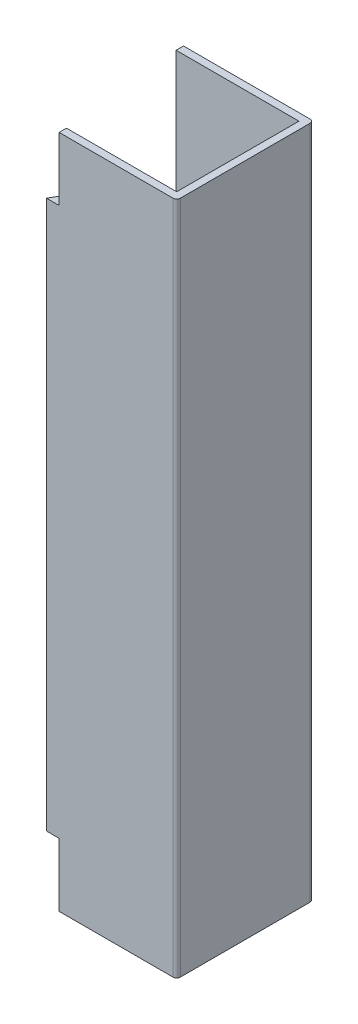
ISO-10303-21;
HEADER;
FILE_DESCRIPTION(('STEP AP214'),'2;1');
FILE_NAME('part.step','',(''),(''),'','','');
FILE_SCHEMA(('AUTOMOTIVE_DESIGN { 1 0 10303 214 1 1 1 1 }'));
ENDSEC;
DATA;
#1=APPLICATION_CONTEXT('core data for automotive mechanical design processes');
#2=APPLICATION_PROTOCOL_DEFINITION('international standard','automotive_design',2000,#1);
#3=PRODUCT_CONTEXT('',#1,'mechanical');
#4=PRODUCT('Part','Part','',(#3));
#5=PRODUCT_RELATED_PRODUCT_CATEGORY('part','',(#4));
#6=PRODUCT_DEFINITION_FORMATION('','',#4);
#7=PRODUCT_DEFINITION_CONTEXT('part definition',#1,'design');
#8=PRODUCT_DEFINITION('design','',#6,#7);
#9=PRODUCT_DEFINITION_SHAPE('','',#8);
#10=(LENGTH_UNIT() NAMED_UNIT(*) SI_UNIT(.MILLI.,.METRE.));
#11=(NAMED_UNIT(*) PLANE_ANGLE_UNIT() SI_UNIT($,.RADIAN.));
#12=(NAMED_UNIT(*) SI_UNIT($,.STERADIAN.) SOLID_ANGLE_UNIT());
#13=UNCERTAINTY_MEASURE_WITH_UNIT(LENGTH_MEASURE(1.E-05),#10,'distance_accuracy_value','');
#14=(GEOMETRIC_REPRESENTATION_CONTEXT(3) GLOBAL_UNCERTAINTY_ASSIGNED_CONTEXT((#13)) GLOBAL_UNIT_ASSIGNED_CONTEXT((#10,
#11,#12)) REPRESENTATION_CONTEXT('',''));
#15=CARTESIAN_POINT('',(0.,0.,0.));
#16=DIRECTION('',(0.,0.,1.));
#17=DIRECTION('',(1.,0.,0.));
#18=AXIS2_PLACEMENT_3D('',#15,#16,#17);
#19=CARTESIAN_POINT('',(3.115,-1.6,0.0175));
#20=DIRECTION('',(1.,0.,0.));
#21=DIRECTION('',(0.,1.,0.));
#22=AXIS2_PLACEMENT_3D('',#19,#20,#21);
#23=PLANE('',#22);
#24=DIRECTION('',(0.,0.,1.));
#25=VECTOR('',#24,1.);
#26=CARTESIAN_POINT('',(3.115,1.6,0.0175));
#27=LINE('',#26,#25);
#28=CARTESIAN_POINT('',(3.115,1.6,0.0349999999999998));
#29=VERTEX_POINT('',#28);
#30=CARTESIAN_POINT('',(3.115,1.6,0.615));
#31=VERTEX_POINT('',#30);
#32=EDGE_CURVE('E119',#29,#31,#27,.T.);
#33=ORIENTED_EDGE('',*,*,#32,.F.);
#34=DIRECTION('',(0.,1.,0.));
#35=VECTOR('',#34,1.);
#36=CARTESIAN_POINT('',(3.115,-1.6,0.0350000000000007));
#37=LINE('',#36,#35);
#38=CARTESIAN_POINT('',(3.115,-1.6,0.0350000000000005));
#39=VERTEX_POINT('',#38);
#40=EDGE_CURVE('E116',#29,#39,#37,.F.);
#41=ORIENTED_EDGE('',*,*,#40,.T.);
#42=DIRECTION('',(0.,0.,1.));
#43=VECTOR('',#42,1.);
#44=CARTESIAN_POINT('',(3.115,-1.6,0.0175));
#45=LINE('',#44,#43);
#46=CARTESIAN_POINT('',(3.115,-1.6,0.615));
#47=VERTEX_POINT('',#46);
#48=EDGE_CURVE('E112',#47,#39,#45,.F.);
#49=ORIENTED_EDGE('',*,*,#48,.F.);
#50=DIRECTION('',(0.,1.,0.));
#51=VECTOR('',#50,1.);
#52=CARTESIAN_POINT('',(3.115,0.,0.615));
#53=LINE('',#52,#51);
#54=EDGE_CURVE('E114',#31,#47,#53,.F.);
#55=ORIENTED_EDGE('',*,*,#54,.F.);
#56=EDGE_LOOP('',(#33,#41,#49,#55));
#57=FACE_BOUND('',#56,.T.);
#58=ADVANCED_FACE('F17',(#57),#23,.F.);
#59=CARTESIAN_POINT('',(2.5325,-1.6,0.035));
#60=DIRECTION('',(0.,0.,-1.));
#61=DIRECTION('',(-1.,0.,0.));
#62=AXIS2_PLACEMENT_3D('',#59,#60,#61);
#63=PLANE('',#62);
#64=DIRECTION('',(-1.,0.,0.));
#65=VECTOR('',#64,1.);
#66=CARTESIAN_POINT('',(2.5325,1.6,0.0349999999999989));
#67=LINE('',#66,#65);
#68=CARTESIAN_POINT('',(2.5325,1.6,0.0349999999999996));
#69=VERTEX_POINT('',#68);
#70=EDGE_CURVE('E150',#69,#29,#67,.F.);
#71=ORIENTED_EDGE('',*,*,#70,.F.);
#72=DIRECTION('',(0.,-1.,0.));
#73=VECTOR('',#72,1.);
#74=CARTESIAN_POINT('',(2.5325,0.,0.035));
#75=LINE('',#74,#73);
#76=CARTESIAN_POINT('',(2.5325,-1.6,0.035));
#77=VERTEX_POINT('',#76);
#78=EDGE_CURVE('E231',#77,#69,#75,.F.);
#79=ORIENTED_EDGE('',*,*,#78,.F.);
#80=DIRECTION('',(-1.,0.,0.));
#81=VECTOR('',#80,1.);
#82=CARTESIAN_POINT('',(2.5325,-1.6,0.035));
#83=LINE('',#82,#81);
#84=EDGE_CURVE('E144',#39,#77,#83,.T.);
#85=ORIENTED_EDGE('',*,*,#84,.F.);
#86=ORIENTED_EDGE('',*,*,#40,.F.);
#87=EDGE_LOOP('',(#71,#79,#85,#86));
#88=FACE_BOUND('',#87,.T.);
#89=ADVANCED_FACE('F272',(#88),#63,.F.);
#90=CARTESIAN_POINT('',(2.828508757436,0.,0.615));
#91=DIRECTION('',(0.,0.,-1.));
#92=DIRECTION('',(0.,1.,0.));
#93=AXIS2_PLACEMENT_3D('',#90,#91,#92);
#94=PLANE('',#93);
#95=DIRECTION('',(0.,1.,0.));
#96=VECTOR('',#95,1.);
#97=CARTESIAN_POINT('',(2.5925,0.,0.615));
#98=LINE('',#97,#96);
#99=CARTESIAN_POINT('',(2.5925,1.3,0.615));
#100=VERTEX_POINT('',#99);
#101=CARTESIAN_POINT('',(2.5925,1.6,0.615));
#102=VERTEX_POINT('',#101);
#103=EDGE_CURVE('E248',#100,#102,#98,.T.);
#104=ORIENTED_EDGE('',*,*,#103,.T.);
#105=DIRECTION('',(1.,0.,0.));
#106=VECTOR('',#105,1.);
#107=CARTESIAN_POINT('',(2.828508757436,1.6,0.615));
#108=LINE('',#107,#106);
#109=EDGE_CURVE('E127',#102,#31,#108,.T.);
#110=ORIENTED_EDGE('',*,*,#109,.T.);
#111=ORIENTED_EDGE('',*,*,#54,.T.);
#112=DIRECTION('',(1.,0.,0.));
#113=VECTOR('',#112,1.);
#114=CARTESIAN_POINT('',(2.828508757436,-1.6,0.615));
#115=LINE('',#114,#113);
#116=CARTESIAN_POINT('',(2.5925,-1.6,0.615));
#117=VERTEX_POINT('',#116);
#118=EDGE_CURVE('E124',#47,#117,#115,.F.);
#119=ORIENTED_EDGE('',*,*,#118,.T.);
#120=DIRECTION('',(0.,1.,0.));
#121=VECTOR('',#120,1.);
#122=CARTESIAN_POINT('',(2.5925,0.,0.615));
#123=LINE('',#122,#121);
#124=CARTESIAN_POINT('',(2.5925,-1.3,0.615));
#125=VERTEX_POINT('',#124);
#126=EDGE_CURVE('E134',#117,#125,#123,.T.);
#127=ORIENTED_EDGE('',*,*,#126,.T.);
#128=DIRECTION('',(1.,0.,0.));
#129=VECTOR('',#128,1.);
#130=CARTESIAN_POINT('',(2.828508757436,-1.3,0.615));
#131=LINE('',#130,#129);
#132=CARTESIAN_POINT('',(2.55270725942,-1.3,0.615));
#133=VERTEX_POINT('',#132);
#134=EDGE_CURVE('E136',#125,#133,#131,.F.);
#135=ORIENTED_EDGE('',*,*,#134,.T.);
#136=DIRECTION('',(0.,1.,0.));
#137=VECTOR('',#136,1.);
#138=CARTESIAN_POINT('',(2.55270725942,-1.3,0.615));
#139=LINE('',#138,#137);
#140=CARTESIAN_POINT('',(2.55270725942,1.3,0.615));
#141=VERTEX_POINT('',#140);
#142=EDGE_CURVE('E218',#133,#141,#139,.T.);
#143=ORIENTED_EDGE('',*,*,#142,.T.);
#144=DIRECTION('',(1.,0.,0.));
#145=VECTOR('',#144,1.);
#146=CARTESIAN_POINT('',(2.5925,1.3,0.615));
#147=LINE('',#146,#145);
#148=EDGE_CURVE('E236',#100,#141,#147,.F.);
#149=ORIENTED_EDGE('',*,*,#148,.F.);
#150=EDGE_LOOP('',(#104,#110,#111,#119,#127,#135,#143,#149));
#151=FACE_BOUND('',#150,.T.);
#152=ADVANCED_FACE('F123',(#151),#94,.T.);
#153=CARTESIAN_POINT('',(2.5325,0.,0.0175));
#154=DIRECTION('',(-1.,0.,0.));
#155=DIRECTION('',(0.,-1.,0.));
#156=AXIS2_PLACEMENT_3D('',#153,#154,#155);
#157=PLANE('',#156);
#158=DIRECTION('',(0.,1.,0.));
#159=VECTOR('',#158,1.);
#160=CARTESIAN_POINT('',(2.5325,1.6,0.));
#161=LINE('',#160,#159);
#162=CARTESIAN_POINT('',(2.5325,1.6,0.));
#163=VERTEX_POINT('',#162);
#164=CARTESIAN_POINT('',(2.5325,-1.6,0.));
#165=VERTEX_POINT('',#164);
#166=EDGE_CURVE('E178',#163,#165,#161,.F.);
#167=ORIENTED_EDGE('',*,*,#166,.T.);
#168=DIRECTION('',(0.,0.,1.));
#169=VECTOR('',#168,1.);
#170=CARTESIAN_POINT('',(2.5325,-1.6,0.0175));
#171=LINE('',#170,#169);
#172=EDGE_CURVE('E230',#165,#77,#171,.T.);
#173=ORIENTED_EDGE('',*,*,#172,.T.);
#174=ORIENTED_EDGE('',*,*,#78,.T.);
#175=DIRECTION('',(0.,0.,1.));
#176=VECTOR('',#175,1.);
#177=CARTESIAN_POINT('',(2.5325,1.6,0.0175));
#178=LINE('',#177,#176);
#179=EDGE_CURVE('E67',#69,#163,#178,.F.);
#180=ORIENTED_EDGE('',*,*,#179,.T.);
#181=EDGE_LOOP('',(#167,#173,#174,#180));
#182=FACE_BOUND('',#181,.T.);
#183=ADVANCED_FACE('F273',(#182),#157,.T.);
#184=CARTESIAN_POINT('',(2.5925,1.3,0.615));
#185=DIRECTION('',(0.,1.,0.));
#186=DIRECTION('',(0.,0.,1.));
#187=AXIS2_PLACEMENT_3D('',#184,#185,#186);
#188=PLANE('',#187);
#189=DIRECTION('',(0.499999999974195,0.,-0.866025403799337));
#190=VECTOR('',#189,1.);
#191=CARTESIAN_POINT('',(2.55270725942,1.3,0.615));
#192=LINE('',#191,#190);
#193=CARTESIAN_POINT('',(2.53249999999994,1.3,0.649999999999964));
#194=VERTEX_POINT('',#193);
#195=EDGE_CURVE('E209',#141,#194,#192,.F.);
#196=ORIENTED_EDGE('',*,*,#195,.T.);
#197=DIRECTION('',(1.,0.,0.));
#198=VECTOR('',#197,1.);
#199=CARTESIAN_POINT('',(2.837236842105,1.3,0.65));
#200=LINE('',#199,#198);
#201=CARTESIAN_POINT('',(2.5925,1.3,0.65));
#202=VERTEX_POINT('',#201);
#203=EDGE_CURVE('E188',#202,#194,#200,.F.);
#204=ORIENTED_EDGE('',*,*,#203,.F.);
#205=DIRECTION('',(0.,0.,1.));
#206=VECTOR('',#205,1.);
#207=CARTESIAN_POINT('',(2.5925,1.3,0.6325));
#208=LINE('',#207,#206);
#209=EDGE_CURVE('E182',#202,#100,#208,.F.);
#210=ORIENTED_EDGE('',*,*,#209,.T.);
#211=ORIENTED_EDGE('',*,*,#148,.T.);
#212=EDGE_LOOP('',(#196,#204,#210,#211));
#213=FACE_BOUND('',#212,.T.);
#214=ADVANCED_FACE('F325',(#213),#188,.T.);
#215=CARTESIAN_POINT('',(2.55270725942,-1.3,0.615));
#216=DIRECTION('',(0.866025403799337,0.,0.499999999974195));
#217=DIRECTION('',(0.499999999974195,0.,-0.866025403799337));
#218=AXIS2_PLACEMENT_3D('',#215,#216,#217);
#219=PLANE('',#218);
#220=DIRECTION('',(0.,-1.,0.));
#221=VECTOR('',#220,1.);
#222=CARTESIAN_POINT('',(2.5325,0.,0.65));
#223=LINE('',#222,#221);
#224=CARTESIAN_POINT('',(2.5325,-1.3,0.65));
#225=VERTEX_POINT('',#224);
#226=EDGE_CURVE('E203',#194,#225,#223,.T.);
#227=ORIENTED_EDGE('',*,*,#226,.F.);
#228=ORIENTED_EDGE('',*,*,#195,.F.);
#229=ORIENTED_EDGE('',*,*,#142,.F.);
#230=DIRECTION('',(0.499999999969617,0.,-0.86602540380198));
#231=VECTOR('',#230,1.);
#232=CARTESIAN_POINT('',(2.5325,-1.3,0.65));
#233=LINE('',#232,#231);
#234=EDGE_CURVE('E206',#225,#133,#233,.T.);
#235=ORIENTED_EDGE('',*,*,#234,.F.);
#236=EDGE_LOOP('',(#227,#228,#229,#235));
#237=FACE_BOUND('',#236,.T.);
#238=ADVANCED_FACE('F316',(#237),#219,.F.);
#239=CARTESIAN_POINT('',(2.5925,-1.3,0.65));
#240=DIRECTION('',(0.,-1.,0.));
#241=DIRECTION('',(0.,0.,-1.));
#242=AXIS2_PLACEMENT_3D('',#239,#240,#241);
#243=PLANE('',#242);
#244=ORIENTED_EDGE('',*,*,#234,.T.);
#245=ORIENTED_EDGE('',*,*,#134,.F.);
#246=DIRECTION('',(0.,0.,1.));
#247=VECTOR('',#246,1.);
#248=CARTESIAN_POINT('',(2.5925,-1.3,0.6325));
#249=LINE('',#248,#247);
#250=CARTESIAN_POINT('',(2.5925,-1.3,0.65));
#251=VERTEX_POINT('',#250);
#252=EDGE_CURVE('E177',#125,#251,#249,.T.);
#253=ORIENTED_EDGE('',*,*,#252,.T.);
#254=DIRECTION('',(1.,0.,0.));
#255=VECTOR('',#254,1.);
#256=CARTESIAN_POINT('',(2.837236842105,-1.3,0.65));
#257=LINE('',#256,#255);
#258=EDGE_CURVE('E200',#225,#251,#257,.T.);
#259=ORIENTED_EDGE('',*,*,#258,.F.);
#260=EDGE_LOOP('',(#244,#245,#253,#259));
#261=FACE_BOUND('',#260,.T.);
#262=ADVANCED_FACE('F318',(#261),#243,.T.);
#263=CARTESIAN_POINT('',(2.5925,0.,0.6325));
#264=DIRECTION('',(1.,0.,0.));
#265=DIRECTION('',(0.,1.,0.));
#266=AXIS2_PLACEMENT_3D('',#263,#264,#265);
#267=PLANE('',#266);
#268=DIRECTION('',(0.,0.,1.));
#269=VECTOR('',#268,1.);
#270=CARTESIAN_POINT('',(2.5925,1.6,0.314647487115));
#271=LINE('',#270,#269);
#272=CARTESIAN_POINT('',(2.5925,1.6,0.65));
#273=VERTEX_POINT('',#272);
#274=EDGE_CURVE('E191',#102,#273,#271,.T.);
#275=ORIENTED_EDGE('',*,*,#274,.F.);
#276=ORIENTED_EDGE('',*,*,#103,.F.);
#277=ORIENTED_EDGE('',*,*,#209,.F.);
#278=DIRECTION('',(0.,-1.,0.));
#279=VECTOR('',#278,1.);
#280=CARTESIAN_POINT('',(2.5925,0.,0.65));
#281=LINE('',#280,#279);
#282=EDGE_CURVE('E185',#273,#202,#281,.T.);
#283=ORIENTED_EDGE('',*,*,#282,.F.);
#284=EDGE_LOOP('',(#275,#276,#277,#283));
#285=FACE_BOUND('',#284,.T.);
#286=ADVANCED_FACE('F331',(#285),#267,.F.);
#287=CARTESIAN_POINT('',(2.5325,1.6,0.));
#288=DIRECTION('',(0.,0.,1.));
#289=DIRECTION('',(1.,0.,0.));
#290=AXIS2_PLACEMENT_3D('',#287,#288,#289);
#291=PLANE('',#290);
#292=DIRECTION('',(1.,0.,0.));
#293=VECTOR('',#292,1.);
#294=CARTESIAN_POINT('',(2.5325,-1.6,0.));
#295=LINE('',#294,#293);
#296=CARTESIAN_POINT('',(3.1325,-1.6,0.));
#297=VERTEX_POINT('',#296);
#298=EDGE_CURVE('E175',#165,#297,#295,.T.);
#299=ORIENTED_EDGE('',*,*,#298,.F.);
#300=ORIENTED_EDGE('',*,*,#166,.F.);
#301=DIRECTION('',(1.,0.,0.));
#302=VECTOR('',#301,1.);
#303=CARTESIAN_POINT('',(2.938919337783,1.6,0.));
#304=LINE('',#303,#302);
#305=CARTESIAN_POINT('',(3.1325,1.6,0.));
#306=VERTEX_POINT('',#305);
#307=EDGE_CURVE('E166',#306,#163,#304,.F.);
#308=ORIENTED_EDGE('',*,*,#307,.F.);
#309=DIRECTION('',(0.,-1.,0.));
#310=VECTOR('',#309,1.);
#311=CARTESIAN_POINT('',(3.1325,1.6,0.));
#312=LINE('',#311,#310);
#313=EDGE_CURVE('E58',#297,#306,#312,.F.);
#314=ORIENTED_EDGE('',*,*,#313,.F.);
#315=EDGE_LOOP('',(#299,#300,#308,#314));
#316=FACE_BOUND('',#315,.T.);
#317=ADVANCED_FACE('F278',(#316),#291,.F.);
#318=CARTESIAN_POINT('',(2.5925,0.,0.6325));
#319=DIRECTION('',(1.,0.,0.));
#320=DIRECTION('',(0.,1.,0.));
#321=AXIS2_PLACEMENT_3D('',#318,#319,#320);
#322=PLANE('',#321);
#323=ORIENTED_EDGE('',*,*,#252,.F.);
#324=ORIENTED_EDGE('',*,*,#126,.F.);
#325=DIRECTION('',(0.,0.,-1.));
#326=VECTOR('',#325,1.);
#327=CARTESIAN_POINT('',(2.5925,-1.6,0.314647487115));
#328=LINE('',#327,#326);
#329=CARTESIAN_POINT('',(2.5925,-1.6,0.65));
#330=VERTEX_POINT('',#329);
#331=EDGE_CURVE('E132',#330,#117,#328,.T.);
#332=ORIENTED_EDGE('',*,*,#331,.F.);
#333=DIRECTION('',(0.,-1.,0.));
#334=VECTOR('',#333,1.);
#335=CARTESIAN_POINT('',(2.5925,0.,0.65));
#336=LINE('',#335,#334);
#337=EDGE_CURVE('E193',#251,#330,#336,.T.);
#338=ORIENTED_EDGE('',*,*,#337,.F.);
#339=EDGE_LOOP('',(#323,#324,#332,#338));
#340=FACE_BOUND('',#339,.T.);
#341=ADVANCED_FACE('F307',(#340),#322,.F.);
#342=CARTESIAN_POINT('',(2.837236842105,0.,0.65));
#343=DIRECTION('',(0.,0.,1.));
#344=DIRECTION('',(0.,-1.,0.));
#345=AXIS2_PLACEMENT_3D('',#342,#343,#344);
#346=PLANE('',#345);
#347=DIRECTION('',(1.,0.,0.));
#348=VECTOR('',#347,1.);
#349=CARTESIAN_POINT('',(2.938919337783,-1.6,0.65));
#350=LINE('',#349,#348);
#351=CARTESIAN_POINT('',(3.1325,-1.6,0.650000000000001));
#352=VERTEX_POINT('',#351);
#353=EDGE_CURVE('E159',#352,#330,#350,.F.);
#354=ORIENTED_EDGE('',*,*,#353,.F.);
#355=DIRECTION('',(0.,-1.,0.));
#356=VECTOR('',#355,1.);
#357=CARTESIAN_POINT('',(3.1325,1.6,0.649999999999999));
#358=LINE('',#357,#356);
#359=CARTESIAN_POINT('',(3.1325,1.6,0.649999999999999));
#360=VERTEX_POINT('',#359);
#361=EDGE_CURVE('E155',#360,#352,#358,.T.);
#362=ORIENTED_EDGE('',*,*,#361,.F.);
#363=DIRECTION('',(1.,0.,0.));
#364=VECTOR('',#363,1.);
#365=CARTESIAN_POINT('',(2.938919337783,1.6,0.65));
#366=LINE('',#365,#364);
#367=EDGE_CURVE('E169',#273,#360,#366,.T.);
#368=ORIENTED_EDGE('',*,*,#367,.F.);
#369=ORIENTED_EDGE('',*,*,#282,.T.);
#370=ORIENTED_EDGE('',*,*,#203,.T.);
#371=ORIENTED_EDGE('',*,*,#226,.T.);
#372=ORIENTED_EDGE('',*,*,#258,.T.);
#373=ORIENTED_EDGE('',*,*,#337,.T.);
#374=EDGE_LOOP('',(#354,#362,#368,#369,#370,#371,#372,#373));
#375=FACE_BOUND('',#374,.T.);
#376=ADVANCED_FACE('F301',(#375),#346,.T.);
#377=CARTESIAN_POINT('',(2.938919337783,1.6,0.314647487115));
#378=DIRECTION('',(0.,1.,0.));
#379=DIRECTION('',(0.,0.,1.));
#380=AXIS2_PLACEMENT_3D('',#377,#378,#379);
#381=PLANE('',#380);
#382=ORIENTED_EDGE('',*,*,#307,.T.);
#383=ORIENTED_EDGE('',*,*,#179,.F.);
#384=ORIENTED_EDGE('',*,*,#70,.T.);
#385=ORIENTED_EDGE('',*,*,#32,.T.);
#386=ORIENTED_EDGE('',*,*,#109,.F.);
#387=ORIENTED_EDGE('',*,*,#274,.T.);
#388=ORIENTED_EDGE('',*,*,#367,.T.);
#389=CARTESIAN_POINT('',(3.1325,1.6,0.632499999999998));
#390=DIRECTION('',(0.,1.,0.));
#391=DIRECTION('',(0.,0.,1.));
#392=AXIS2_PLACEMENT_3D('',#389,#390,#391);
#393=CIRCLE('',#392,0.0175000000000006);
#394=CARTESIAN_POINT('',(3.15,1.6,0.632499999999999));
#395=VERTEX_POINT('',#394);
#396=EDGE_CURVE('E156',#395,#360,#393,.F.);
#397=ORIENTED_EDGE('',*,*,#396,.F.);
#398=DIRECTION('',(0.,0.,1.));
#399=VECTOR('',#398,1.);
#400=CARTESIAN_POINT('',(3.15,1.6,0.0175));
#401=LINE('',#400,#399);
#402=CARTESIAN_POINT('',(3.15,1.6,0.0174999999999992));
#403=VERTEX_POINT('',#402);
#404=EDGE_CURVE('E154',#395,#403,#401,.F.);
#405=ORIENTED_EDGE('',*,*,#404,.T.);
#406=CARTESIAN_POINT('',(3.1325,1.6,0.0174999999999984));
#407=DIRECTION('',(0.,1.,0.));
#408=DIRECTION('',(0.,0.,1.));
#409=AXIS2_PLACEMENT_3D('',#406,#407,#408);
#410=CIRCLE('',#409,0.0174999999999982);
#411=EDGE_CURVE('E20',#306,#403,#410,.F.);
#412=ORIENTED_EDGE('',*,*,#411,.F.);
#413=EDGE_LOOP('',(#382,#383,#384,#385,#386,#387,#388,#397,#405,#412));
#414=FACE_BOUND('',#413,.T.);
#415=ADVANCED_FACE('F269',(#414),#381,.T.);
#416=CARTESIAN_POINT('',(3.1325,1.6,0.0174999999999984));
#417=DIRECTION('',(0.,1.,0.));
#418=DIRECTION('',(0.,0.,1.));
#419=AXIS2_PLACEMENT_3D('',#416,#417,#418);
#420=CYLINDRICAL_SURFACE('',#419,0.0174999999999982);
#421=DIRECTION('',(0.,-1.,0.));
#422=VECTOR('',#421,1.);
#423=CARTESIAN_POINT('',(3.15,1.6,0.0175));
#424=LINE('',#423,#422);
#425=CARTESIAN_POINT('',(3.15,-1.6,0.0174999999999992));
#426=VERTEX_POINT('',#425);
#427=EDGE_CURVE('E280',#403,#426,#424,.T.);
#428=ORIENTED_EDGE('',*,*,#427,.T.);
#429=CARTESIAN_POINT('',(3.1325,-1.6,0.0174999999999984));
#430=DIRECTION('',(0.,1.,0.));
#431=DIRECTION('',(0.,0.,1.));
#432=AXIS2_PLACEMENT_3D('',#429,#430,#431);
#433=CIRCLE('',#432,0.0174999999999982);
#434=EDGE_CURVE('E158',#297,#426,#433,.F.);
#435=ORIENTED_EDGE('',*,*,#434,.F.);
#436=ORIENTED_EDGE('',*,*,#313,.T.);
#437=ORIENTED_EDGE('',*,*,#411,.T.);
#438=EDGE_LOOP('',(#428,#435,#436,#437));
#439=FACE_BOUND('',#438,.T.);
#440=ADVANCED_FACE('F279',(#439),#420,.T.);
#441=CARTESIAN_POINT('',(2.938919337783,-1.6,0.314647487115));
#442=DIRECTION('',(0.,-1.,0.));
#443=DIRECTION('',(0.,0.,-1.));
#444=AXIS2_PLACEMENT_3D('',#441,#442,#443);
#445=PLANE('',#444);
#446=ORIENTED_EDGE('',*,*,#84,.T.);
#447=ORIENTED_EDGE('',*,*,#172,.F.);
#448=ORIENTED_EDGE('',*,*,#298,.T.);
#449=ORIENTED_EDGE('',*,*,#434,.T.);
#450=DIRECTION('',(0.,0.,1.));
#451=VECTOR('',#450,1.);
#452=CARTESIAN_POINT('',(3.15,-1.6,0.0175));
#453=LINE('',#452,#451);
#454=CARTESIAN_POINT('',(3.15,-1.6,0.632499999999999));
#455=VERTEX_POINT('',#454);
#456=EDGE_CURVE('E26',#426,#455,#453,.T.);
#457=ORIENTED_EDGE('',*,*,#456,.T.);
#458=CARTESIAN_POINT('',(3.1325,-1.6,0.632499999999998));
#459=DIRECTION('',(0.,1.,0.));
#460=DIRECTION('',(0.,0.,1.));
#461=AXIS2_PLACEMENT_3D('',#458,#459,#460);
#462=CIRCLE('',#461,0.0175000000000006);
#463=EDGE_CURVE('E34',#352,#455,#462,.T.);
#464=ORIENTED_EDGE('',*,*,#463,.F.);
#465=ORIENTED_EDGE('',*,*,#353,.T.);
#466=ORIENTED_EDGE('',*,*,#331,.T.);
#467=ORIENTED_EDGE('',*,*,#118,.F.);
#468=ORIENTED_EDGE('',*,*,#48,.T.);
#469=EDGE_LOOP('',(#446,#447,#448,#449,#457,#464,#465,#466,#467,#468));
#470=FACE_BOUND('',#469,.T.);
#471=ADVANCED_FACE('F129',(#470),#445,.T.);
#472=CARTESIAN_POINT('',(3.1325,1.6,0.632499999999998));
#473=DIRECTION('',(0.,1.,0.));
#474=DIRECTION('',(0.,0.,1.));
#475=AXIS2_PLACEMENT_3D('',#472,#473,#474);
#476=CYLINDRICAL_SURFACE('',#475,0.0175000000000006);
#477=ORIENTED_EDGE('',*,*,#361,.T.);
#478=ORIENTED_EDGE('',*,*,#463,.T.);
#479=DIRECTION('',(0.,-1.,0.));
#480=VECTOR('',#479,1.);
#481=CARTESIAN_POINT('',(3.15,1.6,0.6325));
#482=LINE('',#481,#480);
#483=EDGE_CURVE('E11',#455,#395,#482,.F.);
#484=ORIENTED_EDGE('',*,*,#483,.T.);
#485=ORIENTED_EDGE('',*,*,#396,.T.);
#486=EDGE_LOOP('',(#477,#478,#484,#485));
#487=FACE_BOUND('',#486,.T.);
#488=ADVANCED_FACE('F334',(#487),#476,.T.);
#489=CARTESIAN_POINT('',(3.15,1.6,0.0175));
#490=DIRECTION('',(-1.,0.,0.));
#491=DIRECTION('',(0.,-1.,0.));
#492=AXIS2_PLACEMENT_3D('',#489,#490,#491);
#493=PLANE('',#492);
#494=ORIENTED_EDGE('',*,*,#456,.F.);
#495=ORIENTED_EDGE('',*,*,#427,.F.);
#496=ORIENTED_EDGE('',*,*,#404,.F.);
#497=ORIENTED_EDGE('',*,*,#483,.F.);
#498=EDGE_LOOP('',(#494,#495,#496,#497));
#499=FACE_BOUND('',#498,.T.);
#500=ADVANCED_FACE('F335',(#499),#493,.F.);
#501=CLOSED_SHELL('',(#58,#89,#152,#183,#214,#238,#262,#286,#317,#341,#376,#415,#440,#471,#488,#500));
#502=MANIFOLD_SOLID_BREP('B1',#501);
#503=ADVANCED_BREP_SHAPE_REPRESENTATION('',(#18,#502),#14);
#504=SHAPE_DEFINITION_REPRESENTATION(#9,#503);
ENDSEC;
END-ISO-10303-21;
